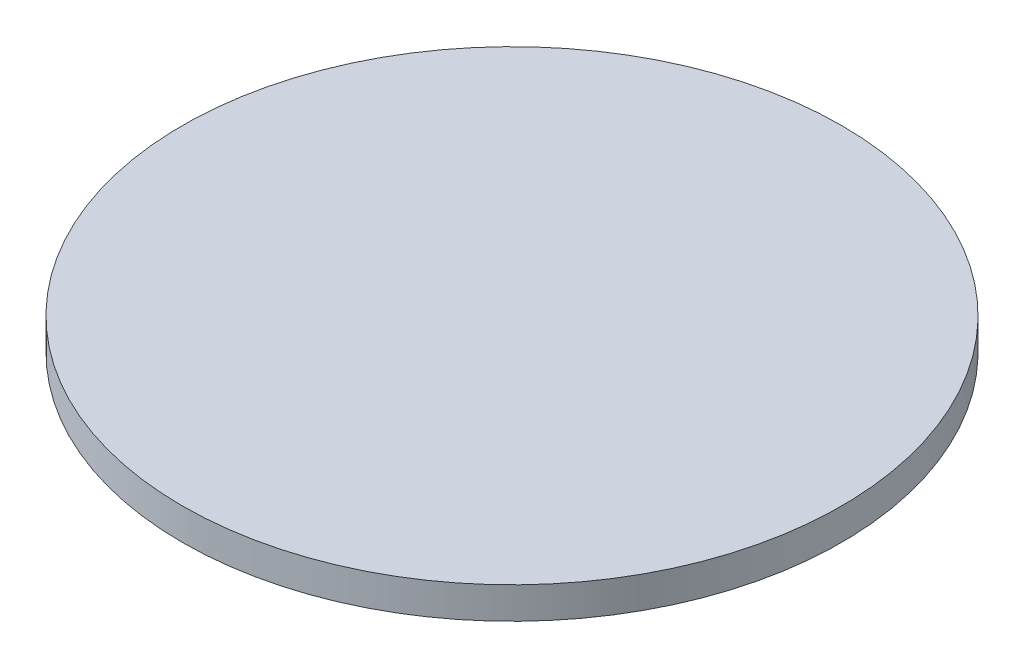
ISO-10303-21;
HEADER;
FILE_DESCRIPTION(('STEP AP214'),'2;1');
FILE_NAME('part.step','',(''),(''),'','','');
FILE_SCHEMA(('AUTOMOTIVE_DESIGN { 1 0 10303 214 1 1 1 1 }'));
ENDSEC;
DATA;
#1=APPLICATION_CONTEXT('core data for automotive mechanical design processes');
#2=APPLICATION_PROTOCOL_DEFINITION('international standard','automotive_design',2000,#1);
#3=PRODUCT_CONTEXT('',#1,'mechanical');
#4=PRODUCT('Part','Part','',(#3));
#5=PRODUCT_RELATED_PRODUCT_CATEGORY('part','',(#4));
#6=PRODUCT_DEFINITION_FORMATION('','',#4);
#7=PRODUCT_DEFINITION_CONTEXT('part definition',#1,'design');
#8=PRODUCT_DEFINITION('design','',#6,#7);
#9=PRODUCT_DEFINITION_SHAPE('','',#8);
#10=(LENGTH_UNIT() NAMED_UNIT(*) SI_UNIT(.MILLI.,.METRE.));
#11=(NAMED_UNIT(*) PLANE_ANGLE_UNIT() SI_UNIT($,.RADIAN.));
#12=(NAMED_UNIT(*) SI_UNIT($,.STERADIAN.) SOLID_ANGLE_UNIT());
#13=UNCERTAINTY_MEASURE_WITH_UNIT(LENGTH_MEASURE(1.E-05),#10,'distance_accuracy_value','');
#14=(GEOMETRIC_REPRESENTATION_CONTEXT(3) GLOBAL_UNCERTAINTY_ASSIGNED_CONTEXT((#13)) GLOBAL_UNIT_ASSIGNED_CONTEXT((#10,
#11,#12)) REPRESENTATION_CONTEXT('',''));
#15=CARTESIAN_POINT('',(0.,0.,0.));
#16=DIRECTION('',(0.,0.,1.));
#17=DIRECTION('',(1.,0.,0.));
#18=AXIS2_PLACEMENT_3D('',#15,#16,#17);
#19=CARTESIAN_POINT('',(0.,3.175,0.));
#20=DIRECTION('',(0.,-1.,0.));
#21=DIRECTION('',(0.,0.,-1.));
#22=AXIS2_PLACEMENT_3D('',#19,#20,#21);
#23=CYLINDRICAL_SURFACE('',#22,33.0835);
#24=CARTESIAN_POINT('',(0.,3.175,0.));
#25=DIRECTION('',(0.,1.,0.));
#26=DIRECTION('',(0.,0.,1.));
#27=AXIS2_PLACEMENT_3D('',#24,#25,#26);
#28=CIRCLE('',#27,33.0835);
#29=CARTESIAN_POINT('',(0.,3.175,33.0835));
#30=VERTEX_POINT('',#29);
#31=EDGE_CURVE('E10',#30,#30,#28,.T.);
#32=ORIENTED_EDGE('',*,*,#31,.F.);
#33=EDGE_LOOP('',(#32));
#34=FACE_BOUND('',#33,.T.);
#35=CARTESIAN_POINT('',(0.,0.,0.));
#36=DIRECTION('',(0.,1.,0.));
#37=DIRECTION('',(0.,0.,1.));
#38=AXIS2_PLACEMENT_3D('',#35,#36,#37);
#39=CIRCLE('',#38,33.0835);
#40=CARTESIAN_POINT('',(0.,0.,33.0835));
#41=VERTEX_POINT('',#40);
#42=EDGE_CURVE('E42',#41,#41,#39,.T.);
#43=ORIENTED_EDGE('',*,*,#42,.T.);
#44=EDGE_LOOP('',(#43));
#45=FACE_BOUND('',#44,.T.);
#46=ADVANCED_FACE('F39',(#34,#45),#23,.T.);
#47=CARTESIAN_POINT('',(0.,3.175,0.));
#48=DIRECTION('',(0.,1.,0.));
#49=DIRECTION('',(0.,0.,1.));
#50=AXIS2_PLACEMENT_3D('',#47,#48,#49);
#51=PLANE('',#50);
#52=ORIENTED_EDGE('',*,*,#31,.T.);
#53=EDGE_LOOP('',(#52));
#54=FACE_BOUND('',#53,.T.);
#55=ADVANCED_FACE('F54',(#54),#51,.T.);
#56=CARTESIAN_POINT('',(0.,0.,0.));
#57=DIRECTION('',(0.,1.,0.));
#58=DIRECTION('',(0.,0.,1.));
#59=AXIS2_PLACEMENT_3D('',#56,#57,#58);
#60=PLANE('',#59);
#61=ORIENTED_EDGE('',*,*,#42,.F.);
#62=EDGE_LOOP('',(#61));
#63=FACE_BOUND('',#62,.T.);
#64=ADVANCED_FACE('F52',(#63),#60,.F.);
#65=CLOSED_SHELL('',(#46,#55,#64));
#66=MANIFOLD_SOLID_BREP('B2',#65);
#67=ADVANCED_BREP_SHAPE_REPRESENTATION('',(#18,#66),#14);
#68=SHAPE_DEFINITION_REPRESENTATION(#9,#67);
ENDSEC;
END-ISO-10303-21;
